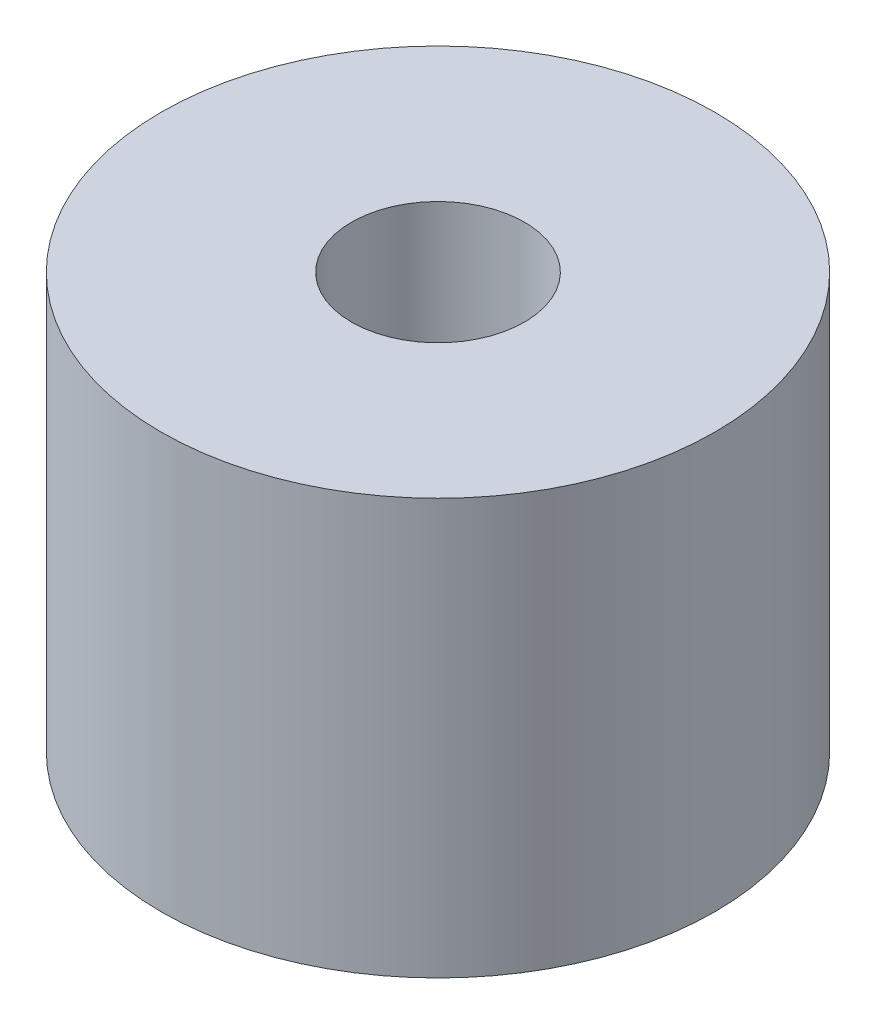
ISO-10303-21;
HEADER;
FILE_DESCRIPTION(('STEP AP214'),'2;1');
FILE_NAME('part.step','',(''),(''),'','','');
FILE_SCHEMA(('AUTOMOTIVE_DESIGN { 1 0 10303 214 1 1 1 1 }'));
ENDSEC;
DATA;
#1=APPLICATION_CONTEXT('core data for automotive mechanical design processes');
#2=APPLICATION_PROTOCOL_DEFINITION('international standard','automotive_design',2000,#1);
#3=PRODUCT_CONTEXT('',#1,'mechanical');
#4=PRODUCT('Part','Part','',(#3));
#5=PRODUCT_RELATED_PRODUCT_CATEGORY('part','',(#4));
#6=PRODUCT_DEFINITION_FORMATION('','',#4);
#7=PRODUCT_DEFINITION_CONTEXT('part definition',#1,'design');
#8=PRODUCT_DEFINITION('design','',#6,#7);
#9=PRODUCT_DEFINITION_SHAPE('','',#8);
#10=(LENGTH_UNIT() NAMED_UNIT(*) SI_UNIT(.MILLI.,.METRE.));
#11=(NAMED_UNIT(*) PLANE_ANGLE_UNIT() SI_UNIT($,.RADIAN.));
#12=(NAMED_UNIT(*) SI_UNIT($,.STERADIAN.) SOLID_ANGLE_UNIT());
#13=UNCERTAINTY_MEASURE_WITH_UNIT(LENGTH_MEASURE(1.E-05),#10,'distance_accuracy_value','');
#14=(GEOMETRIC_REPRESENTATION_CONTEXT(3) GLOBAL_UNCERTAINTY_ASSIGNED_CONTEXT((#13)) GLOBAL_UNIT_ASSIGNED_CONTEXT((#10,
#11,#12)) REPRESENTATION_CONTEXT('',''));
#15=CARTESIAN_POINT('',(0.,0.,0.));
#16=DIRECTION('',(0.,0.,1.));
#17=DIRECTION('',(1.,0.,0.));
#18=AXIS2_PLACEMENT_3D('',#15,#16,#17);
#19=CARTESIAN_POINT('',(0.,19.05,0.));
#20=DIRECTION('',(0.,-1.,0.));
#21=DIRECTION('',(0.,0.,-1.));
#22=AXIS2_PLACEMENT_3D('',#19,#20,#21);
#23=CYLINDRICAL_SURFACE('',#22,12.7);
#24=CARTESIAN_POINT('',(0.,19.05,0.));
#25=DIRECTION('',(0.,1.,0.));
#26=DIRECTION('',(0.,0.,1.));
#27=AXIS2_PLACEMENT_3D('',#24,#25,#26);
#28=CIRCLE('',#27,12.7);
#29=CARTESIAN_POINT('',(0.,19.05,12.7));
#30=VERTEX_POINT('',#29);
#31=EDGE_CURVE('E10',#30,#30,#28,.T.);
#32=ORIENTED_EDGE('',*,*,#31,.F.);
#33=EDGE_LOOP('',(#32));
#34=FACE_BOUND('',#33,.T.);
#35=CARTESIAN_POINT('',(0.,0.,0.));
#36=DIRECTION('',(0.,1.,0.));
#37=DIRECTION('',(0.,0.,1.));
#38=AXIS2_PLACEMENT_3D('',#35,#36,#37);
#39=CIRCLE('',#38,12.7);
#40=CARTESIAN_POINT('',(0.,0.,12.7));
#41=VERTEX_POINT('',#40);
#42=EDGE_CURVE('E46',#41,#41,#39,.T.);
#43=ORIENTED_EDGE('',*,*,#42,.T.);
#44=EDGE_LOOP('',(#43));
#45=FACE_BOUND('',#44,.T.);
#46=ADVANCED_FACE('F43',(#34,#45),#23,.T.);
#47=CARTESIAN_POINT('',(0.,19.05,0.));
#48=DIRECTION('',(0.,1.,0.));
#49=DIRECTION('',(0.,0.,1.));
#50=AXIS2_PLACEMENT_3D('',#47,#48,#49);
#51=PLANE('',#50);
#52=CARTESIAN_POINT('',(0.,19.05,0.));
#53=DIRECTION('',(0.,1.,0.));
#54=DIRECTION('',(0.,0.,1.));
#55=AXIS2_PLACEMENT_3D('',#52,#53,#54);
#56=CIRCLE('',#55,3.96874999999999);
#57=CARTESIAN_POINT('',(0.,19.05,3.96874999999999));
#58=VERTEX_POINT('',#57);
#59=EDGE_CURVE('E60',#58,#58,#56,.T.);
#60=ORIENTED_EDGE('',*,*,#59,.F.);
#61=EDGE_LOOP('',(#60));
#62=FACE_BOUND('',#61,.T.);
#63=ORIENTED_EDGE('',*,*,#31,.T.);
#64=EDGE_LOOP('',(#63));
#65=FACE_BOUND('',#64,.T.);
#66=ADVANCED_FACE('F67',(#62,#65),#51,.T.);
#67=CARTESIAN_POINT('',(0.,0.,0.));
#68=DIRECTION('',(0.,1.,0.));
#69=DIRECTION('',(0.,0.,1.));
#70=AXIS2_PLACEMENT_3D('',#67,#68,#69);
#71=PLANE('',#70);
#72=CARTESIAN_POINT('',(0.,0.,0.));
#73=DIRECTION('',(0.,1.,0.));
#74=DIRECTION('',(0.,0.,1.));
#75=AXIS2_PLACEMENT_3D('',#72,#73,#74);
#76=CIRCLE('',#75,3.96875);
#77=CARTESIAN_POINT('',(0.,0.,3.96875));
#78=VERTEX_POINT('',#77);
#79=EDGE_CURVE('E55',#78,#78,#76,.T.);
#80=ORIENTED_EDGE('',*,*,#79,.T.);
#81=EDGE_LOOP('',(#80));
#82=FACE_BOUND('',#81,.T.);
#83=ORIENTED_EDGE('',*,*,#42,.F.);
#84=EDGE_LOOP('',(#83));
#85=FACE_BOUND('',#84,.T.);
#86=ADVANCED_FACE('F69',(#82,#85),#71,.F.);
#87=CARTESIAN_POINT('',(0.,19.05,0.));
#88=DIRECTION('',(0.,1.,0.));
#89=DIRECTION('',(0.,0.,1.));
#90=AXIS2_PLACEMENT_3D('',#87,#88,#89);
#91=CYLINDRICAL_SURFACE('',#90,3.96874999999999);
#92=ORIENTED_EDGE('',*,*,#79,.F.);
#93=EDGE_LOOP('',(#92));
#94=FACE_BOUND('',#93,.T.);
#95=ORIENTED_EDGE('',*,*,#59,.T.);
#96=EDGE_LOOP('',(#95));
#97=FACE_BOUND('',#96,.T.);
#98=ADVANCED_FACE('F65',(#94,#97),#91,.F.);
#99=CLOSED_SHELL('',(#46,#66,#86,#98));
#100=MANIFOLD_SOLID_BREP('B2',#99);
#101=ADVANCED_BREP_SHAPE_REPRESENTATION('',(#18,#100),#14);
#102=SHAPE_DEFINITION_REPRESENTATION(#9,#101);
ENDSEC;
END-ISO-10303-21;
